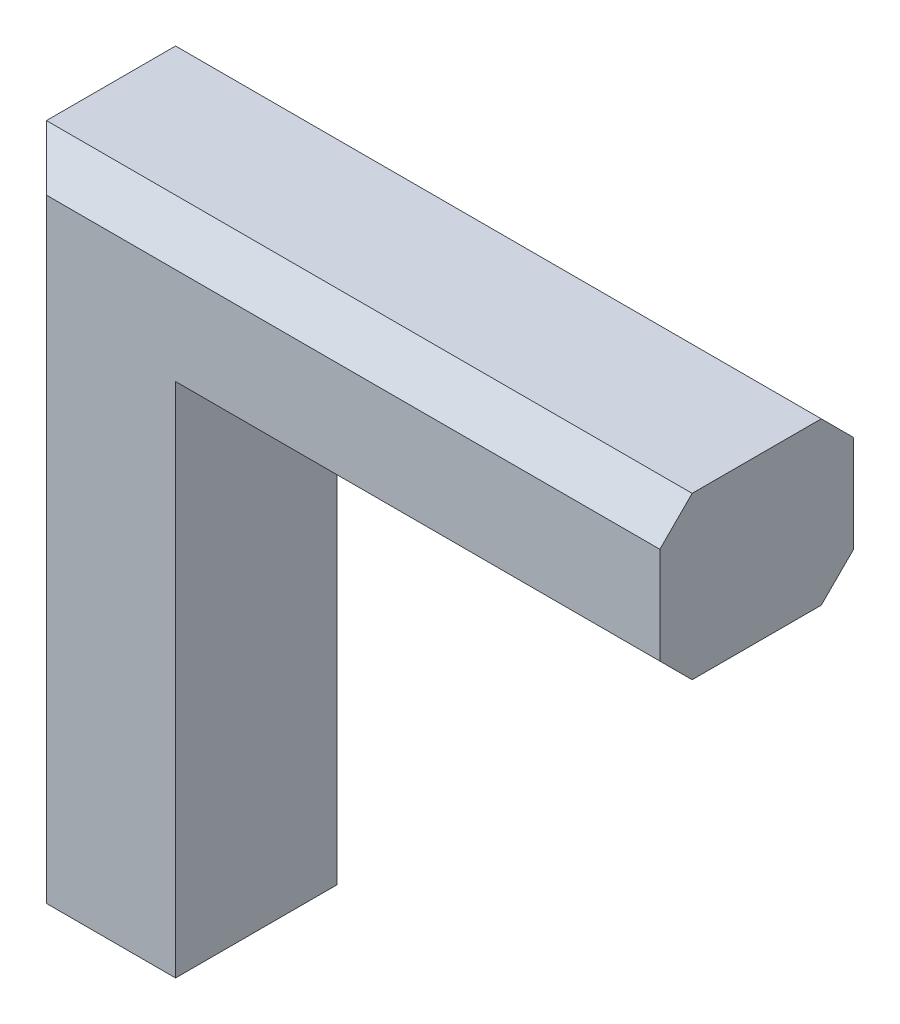
ISO-10303-21;
HEADER;
FILE_DESCRIPTION(('STEP AP214'),'2;1');
FILE_NAME('part.step','',(''),(''),'','','');
FILE_SCHEMA(('AUTOMOTIVE_DESIGN { 1 0 10303 214 1 1 1 1 }'));
ENDSEC;
DATA;
#1=APPLICATION_CONTEXT('core data for automotive mechanical design processes');
#2=APPLICATION_PROTOCOL_DEFINITION('international standard','automotive_design',2000,#1);
#3=PRODUCT_CONTEXT('',#1,'mechanical');
#4=PRODUCT('Part','Part','',(#3));
#5=PRODUCT_RELATED_PRODUCT_CATEGORY('part','',(#4));
#6=PRODUCT_DEFINITION_FORMATION('','',#4);
#7=PRODUCT_DEFINITION_CONTEXT('part definition',#1,'design');
#8=PRODUCT_DEFINITION('design','',#6,#7);
#9=PRODUCT_DEFINITION_SHAPE('','',#8);
#10=(LENGTH_UNIT() NAMED_UNIT(*) SI_UNIT(.MILLI.,.METRE.));
#11=(NAMED_UNIT(*) PLANE_ANGLE_UNIT() SI_UNIT($,.RADIAN.));
#12=(NAMED_UNIT(*) SI_UNIT($,.STERADIAN.) SOLID_ANGLE_UNIT());
#13=UNCERTAINTY_MEASURE_WITH_UNIT(LENGTH_MEASURE(1.E-05),#10,'distance_accuracy_value','');
#14=(GEOMETRIC_REPRESENTATION_CONTEXT(3) GLOBAL_UNCERTAINTY_ASSIGNED_CONTEXT((#13)) GLOBAL_UNIT_ASSIGNED_CONTEXT((#10,
#11,#12)) REPRESENTATION_CONTEXT('',''));
#15=CARTESIAN_POINT('',(0.,0.,0.));
#16=DIRECTION('',(0.,0.,1.));
#17=DIRECTION('',(1.,0.,0.));
#18=AXIS2_PLACEMENT_3D('',#15,#16,#17);
#19=CARTESIAN_POINT('',(0.5,-3.75,0.5));
#20=DIRECTION('',(-0.707106781186547,0.,-0.707106781186548));
#21=DIRECTION('',(-0.707106781186548,0.,0.707106781186547));
#22=AXIS2_PLACEMENT_3D('',#19,#20,#21);
#23=PLANE('',#22);
#24=DIRECTION('',(0.,1.,0.));
#25=VECTOR('',#24,1.);
#26=CARTESIAN_POINT('',(0.,0.,1.));
#27=LINE('',#26,#25);
#28=CARTESIAN_POINT('',(0.,5.,1.));
#29=VERTEX_POINT('',#28);
#30=CARTESIAN_POINT('',(0.,-15.,1.));
#31=VERTEX_POINT('',#30);
#32=EDGE_CURVE('E111',#29,#31,#27,.F.);
#33=ORIENTED_EDGE('',*,*,#32,.F.);
#34=DIRECTION('',(-0.577350269189626,0.577350269189626,0.577350269189625));
#35=VECTOR('',#34,1.);
#36=CARTESIAN_POINT('',(1.,4.,0.));
#37=LINE('',#36,#35);
#38=CARTESIAN_POINT('',(0.999999999999999,4.,0.));
#39=VERTEX_POINT('',#38);
#40=EDGE_CURVE('E105',#39,#29,#37,.T.);
#41=ORIENTED_EDGE('',*,*,#40,.F.);
#42=DIRECTION('',(0.,1.,0.));
#43=VECTOR('',#42,1.);
#44=CARTESIAN_POINT('',(1.,-7.5,0.));
#45=LINE('',#44,#43);
#46=CARTESIAN_POINT('',(1.,-15.,0.));
#47=VERTEX_POINT('',#46);
#48=EDGE_CURVE('E108',#39,#47,#45,.F.);
#49=ORIENTED_EDGE('',*,*,#48,.T.);
#50=DIRECTION('',(-0.707106781186548,0.,0.707106781186547));
#51=VECTOR('',#50,1.);
#52=CARTESIAN_POINT('',(0.5,-15.,0.5));
#53=LINE('',#52,#51);
#54=EDGE_CURVE('E19',#47,#31,#53,.T.);
#55=ORIENTED_EDGE('',*,*,#54,.T.);
#56=EDGE_LOOP('',(#33,#41,#49,#55));
#57=FACE_BOUND('',#56,.T.);
#58=ADVANCED_FACE('F16',(#57),#23,.T.);
#59=CARTESIAN_POINT('',(11.25,4.5,0.5));
#60=DIRECTION('',(0.,0.707106781186547,-0.707106781186548));
#61=DIRECTION('',(0.,0.707106781186548,0.707106781186547));
#62=AXIS2_PLACEMENT_3D('',#59,#60,#61);
#63=PLANE('',#62);
#64=DIRECTION('',(1.,0.,0.));
#65=VECTOR('',#64,1.);
#66=CARTESIAN_POINT('',(2.5,4.,0.));
#67=LINE('',#66,#65);
#68=CARTESIAN_POINT('',(20.,4.,0.));
#69=VERTEX_POINT('',#68);
#70=EDGE_CURVE('E119',#69,#39,#67,.F.);
#71=ORIENTED_EDGE('',*,*,#70,.T.);
#72=ORIENTED_EDGE('',*,*,#40,.T.);
#73=DIRECTION('',(1.,0.,0.));
#74=VECTOR('',#73,1.);
#75=CARTESIAN_POINT('',(20.,5.,1.));
#76=LINE('',#75,#74);
#77=CARTESIAN_POINT('',(20.,5.,1.));
#78=VERTEX_POINT('',#77);
#79=EDGE_CURVE('E171',#78,#29,#76,.F.);
#80=ORIENTED_EDGE('',*,*,#79,.F.);
#81=DIRECTION('',(0.,0.707106781186548,0.707106781186547));
#82=VECTOR('',#81,1.);
#83=CARTESIAN_POINT('',(20.,4.5,0.5));
#84=LINE('',#83,#82);
#85=EDGE_CURVE('E116',#78,#69,#84,.F.);
#86=ORIENTED_EDGE('',*,*,#85,.T.);
#87=EDGE_LOOP('',(#71,#72,#80,#86));
#88=FACE_BOUND('',#87,.T.);
#89=ADVANCED_FACE('F120',(#88),#63,.T.);
#90=CARTESIAN_POINT('',(1.25,0.5,0.5));
#91=DIRECTION('',(0.,-0.707106781186548,-0.707106781186547));
#92=DIRECTION('',(0.,0.707106781186547,-0.707106781186548));
#93=AXIS2_PLACEMENT_3D('',#90,#91,#92);
#94=PLANE('',#93);
#95=DIRECTION('',(1.,0.,0.));
#96=VECTOR('',#95,1.);
#97=CARTESIAN_POINT('',(0.,0.,1.));
#98=LINE('',#97,#96);
#99=CARTESIAN_POINT('',(5.,0.,1.));
#100=VERTEX_POINT('',#99);
#101=CARTESIAN_POINT('',(20.,0.,1.));
#102=VERTEX_POINT('',#101);
#103=EDGE_CURVE('E167',#100,#102,#98,.T.);
#104=ORIENTED_EDGE('',*,*,#103,.F.);
#105=DIRECTION('',(0.577350269189625,-0.577350269189626,0.577350269189626));
#106=VECTOR('',#105,1.);
#107=CARTESIAN_POINT('',(4.,1.,0.));
#108=LINE('',#107,#106);
#109=CARTESIAN_POINT('',(4.,1.,0.));
#110=VERTEX_POINT('',#109);
#111=EDGE_CURVE('E99',#110,#100,#108,.T.);
#112=ORIENTED_EDGE('',*,*,#111,.F.);
#113=DIRECTION('',(1.,0.,0.));
#114=VECTOR('',#113,1.);
#115=CARTESIAN_POINT('',(2.5,1.,0.));
#116=LINE('',#115,#114);
#117=CARTESIAN_POINT('',(20.,1.,0.));
#118=VERTEX_POINT('',#117);
#119=EDGE_CURVE('E131',#110,#118,#116,.T.);
#120=ORIENTED_EDGE('',*,*,#119,.T.);
#121=DIRECTION('',(0.,0.707106781186547,-0.707106781186548));
#122=VECTOR('',#121,1.);
#123=CARTESIAN_POINT('',(20.,0.5,0.5));
#124=LINE('',#123,#122);
#125=EDGE_CURVE('E115',#118,#102,#124,.F.);
#126=ORIENTED_EDGE('',*,*,#125,.T.);
#127=EDGE_LOOP('',(#104,#112,#120,#126));
#128=FACE_BOUND('',#127,.T.);
#129=ADVANCED_FACE('F173',(#128),#94,.T.);
#130=CARTESIAN_POINT('',(0.,0.,0.));
#131=DIRECTION('',(-1.,0.,0.));
#132=DIRECTION('',(0.,0.,1.));
#133=AXIS2_PLACEMENT_3D('',#130,#131,#132);
#134=PLANE('',#133);
#135=DIRECTION('',(0.,1.,0.));
#136=VECTOR('',#135,1.);
#137=CARTESIAN_POINT('',(0.,-3.75,5.));
#138=LINE('',#137,#136);
#139=CARTESIAN_POINT('',(0.,5.,5.));
#140=VERTEX_POINT('',#139);
#141=CARTESIAN_POINT('',(0.,-15.,5.));
#142=VERTEX_POINT('',#141);
#143=EDGE_CURVE('E159',#140,#142,#138,.F.);
#144=ORIENTED_EDGE('',*,*,#143,.F.);
#145=DIRECTION('',(0.,0.,1.));
#146=VECTOR('',#145,1.);
#147=CARTESIAN_POINT('',(0.,5.,0.));
#148=LINE('',#147,#146);
#149=EDGE_CURVE('E145',#29,#140,#148,.T.);
#150=ORIENTED_EDGE('',*,*,#149,.F.);
#151=ORIENTED_EDGE('',*,*,#32,.T.);
#152=DIRECTION('',(0.,0.,-1.));
#153=VECTOR('',#152,1.);
#154=CARTESIAN_POINT('',(0.,-15.,0.));
#155=LINE('',#154,#153);
#156=EDGE_CURVE('E143',#142,#31,#155,.T.);
#157=ORIENTED_EDGE('',*,*,#156,.F.);
#158=EDGE_LOOP('',(#144,#150,#151,#157));
#159=FACE_BOUND('',#158,.T.);
#160=ADVANCED_FACE('F142',(#159),#134,.T.);
#161=CARTESIAN_POINT('',(4.5,-11.25,0.5));
#162=DIRECTION('',(0.707106781186548,0.,-0.707106781186547));
#163=DIRECTION('',(-0.707106781186547,0.,-0.707106781186548));
#164=AXIS2_PLACEMENT_3D('',#161,#162,#163);
#165=PLANE('',#164);
#166=DIRECTION('',(0.,1.,0.));
#167=VECTOR('',#166,1.);
#168=CARTESIAN_POINT('',(4.,-7.5,0.));
#169=LINE('',#168,#167);
#170=CARTESIAN_POINT('',(4.,-15.,0.));
#171=VERTEX_POINT('',#170);
#172=EDGE_CURVE('E129',#171,#110,#169,.T.);
#173=ORIENTED_EDGE('',*,*,#172,.T.);
#174=ORIENTED_EDGE('',*,*,#111,.T.);
#175=DIRECTION('',(0.,1.,0.));
#176=VECTOR('',#175,1.);
#177=CARTESIAN_POINT('',(5.,-15.,1.));
#178=LINE('',#177,#176);
#179=CARTESIAN_POINT('',(5.,-15.,1.));
#180=VERTEX_POINT('',#179);
#181=EDGE_CURVE('E151',#180,#100,#178,.T.);
#182=ORIENTED_EDGE('',*,*,#181,.F.);
#183=DIRECTION('',(0.707106781186548,0.,0.707106781186548));
#184=VECTOR('',#183,1.);
#185=CARTESIAN_POINT('',(4.,-15.,0.));
#186=LINE('',#185,#184);
#187=EDGE_CURVE('E153',#171,#180,#186,.T.);
#188=ORIENTED_EDGE('',*,*,#187,.F.);
#189=EDGE_LOOP('',(#173,#174,#182,#188));
#190=FACE_BOUND('',#189,.T.);
#191=ADVANCED_FACE('F199',(#190),#165,.T.);
#192=CARTESIAN_POINT('',(2.5,-7.5,0.));
#193=DIRECTION('',(0.,0.,1.));
#194=DIRECTION('',(1.,0.,0.));
#195=AXIS2_PLACEMENT_3D('',#192,#193,#194);
#196=PLANE('',#195);
#197=ORIENTED_EDGE('',*,*,#172,.F.);
#198=DIRECTION('',(1.,0.,0.));
#199=VECTOR('',#198,1.);
#200=CARTESIAN_POINT('',(0.,-15.,0.));
#201=LINE('',#200,#199);
#202=EDGE_CURVE('E128',#47,#171,#201,.T.);
#203=ORIENTED_EDGE('',*,*,#202,.F.);
#204=ORIENTED_EDGE('',*,*,#48,.F.);
#205=ORIENTED_EDGE('',*,*,#70,.F.);
#206=DIRECTION('',(0.,1.,0.));
#207=VECTOR('',#206,1.);
#208=CARTESIAN_POINT('',(20.,0.,0.));
#209=LINE('',#208,#207);
#210=EDGE_CURVE('E174',#118,#69,#209,.T.);
#211=ORIENTED_EDGE('',*,*,#210,.F.);
#212=ORIENTED_EDGE('',*,*,#119,.F.);
#213=EDGE_LOOP('',(#197,#203,#204,#205,#211,#212));
#214=FACE_BOUND('',#213,.T.);
#215=ADVANCED_FACE('F126',(#214),#196,.F.);
#216=CARTESIAN_POINT('',(20.,5.,0.));
#217=DIRECTION('',(0.,1.,0.));
#218=DIRECTION('',(0.,0.,1.));
#219=AXIS2_PLACEMENT_3D('',#216,#217,#218);
#220=PLANE('',#219);
#221=ORIENTED_EDGE('',*,*,#79,.T.);
#222=ORIENTED_EDGE('',*,*,#149,.T.);
#223=DIRECTION('',(1.,0.,0.));
#224=VECTOR('',#223,1.);
#225=CARTESIAN_POINT('',(11.25,5.,5.));
#226=LINE('',#225,#224);
#227=CARTESIAN_POINT('',(20.,5.,5.));
#228=VERTEX_POINT('',#227);
#229=EDGE_CURVE('E164',#228,#140,#226,.F.);
#230=ORIENTED_EDGE('',*,*,#229,.F.);
#231=DIRECTION('',(0.,0.,-1.));
#232=VECTOR('',#231,1.);
#233=CARTESIAN_POINT('',(20.,5.,0.));
#234=LINE('',#233,#232);
#235=EDGE_CURVE('E176',#78,#228,#234,.F.);
#236=ORIENTED_EDGE('',*,*,#235,.F.);
#237=EDGE_LOOP('',(#221,#222,#230,#236));
#238=FACE_BOUND('',#237,.T.);
#239=ADVANCED_FACE('F232',(#238),#220,.T.);
#240=CARTESIAN_POINT('',(0.,0.,0.));
#241=DIRECTION('',(0.,-1.,0.));
#242=DIRECTION('',(0.,0.,-1.));
#243=AXIS2_PLACEMENT_3D('',#240,#241,#242);
#244=PLANE('',#243);
#245=DIRECTION('',(1.,0.,0.));
#246=VECTOR('',#245,1.);
#247=CARTESIAN_POINT('',(1.25,0.,5.));
#248=LINE('',#247,#246);
#249=CARTESIAN_POINT('',(5.,0.,5.));
#250=VERTEX_POINT('',#249);
#251=CARTESIAN_POINT('',(20.,0.,5.));
#252=VERTEX_POINT('',#251);
#253=EDGE_CURVE('E177',#250,#252,#248,.T.);
#254=ORIENTED_EDGE('',*,*,#253,.F.);
#255=DIRECTION('',(0.,0.,-1.));
#256=VECTOR('',#255,1.);
#257=CARTESIAN_POINT('',(5.,0.,0.));
#258=LINE('',#257,#256);
#259=EDGE_CURVE('E191',#100,#250,#258,.F.);
#260=ORIENTED_EDGE('',*,*,#259,.F.);
#261=ORIENTED_EDGE('',*,*,#103,.T.);
#262=DIRECTION('',(0.,0.,-1.));
#263=VECTOR('',#262,1.);
#264=CARTESIAN_POINT('',(20.,0.,0.));
#265=LINE('',#264,#263);
#266=EDGE_CURVE('E218',#252,#102,#265,.T.);
#267=ORIENTED_EDGE('',*,*,#266,.F.);
#268=EDGE_LOOP('',(#254,#260,#261,#267));
#269=FACE_BOUND('',#268,.T.);
#270=ADVANCED_FACE('F229',(#269),#244,.T.);
#271=CARTESIAN_POINT('',(11.25,4.5,5.5));
#272=DIRECTION('',(0.,0.707106781186547,0.707106781186548));
#273=DIRECTION('',(0.,-0.707106781186548,0.707106781186547));
#274=AXIS2_PLACEMENT_3D('',#271,#272,#273);
#275=PLANE('',#274);
#276=DIRECTION('',(0.,-0.707106781186548,0.707106781186548));
#277=VECTOR('',#276,1.);
#278=CARTESIAN_POINT('',(20.,5.,5.));
#279=LINE('',#278,#277);
#280=CARTESIAN_POINT('',(20.,4.,6.));
#281=VERTEX_POINT('',#280);
#282=EDGE_CURVE('E180',#228,#281,#279,.T.);
#283=ORIENTED_EDGE('',*,*,#282,.F.);
#284=ORIENTED_EDGE('',*,*,#229,.T.);
#285=DIRECTION('',(-0.577350269189626,0.577350269189626,-0.577350269189625));
#286=VECTOR('',#285,1.);
#287=CARTESIAN_POINT('',(1.,4.,6.));
#288=LINE('',#287,#286);
#289=CARTESIAN_POINT('',(1.,4.,6.));
#290=VERTEX_POINT('',#289);
#291=EDGE_CURVE('E161',#290,#140,#288,.T.);
#292=ORIENTED_EDGE('',*,*,#291,.F.);
#293=DIRECTION('',(1.,0.,0.));
#294=VECTOR('',#293,1.);
#295=CARTESIAN_POINT('',(2.5,4.,6.));
#296=LINE('',#295,#294);
#297=EDGE_CURVE('E213',#281,#290,#296,.F.);
#298=ORIENTED_EDGE('',*,*,#297,.F.);
#299=EDGE_LOOP('',(#283,#284,#292,#298));
#300=FACE_BOUND('',#299,.T.);
#301=ADVANCED_FACE('F231',(#300),#275,.T.);
#302=CARTESIAN_POINT('',(0.5,-3.75,5.5));
#303=DIRECTION('',(-0.707106781186547,0.,0.707106781186548));
#304=DIRECTION('',(0.707106781186548,0.,0.707106781186547));
#305=AXIS2_PLACEMENT_3D('',#302,#303,#304);
#306=PLANE('',#305);
#307=DIRECTION('',(-0.707106781186548,0.,-0.707106781186548));
#308=VECTOR('',#307,1.);
#309=CARTESIAN_POINT('',(1.,-15.,6.));
#310=LINE('',#309,#308);
#311=CARTESIAN_POINT('',(1.,-15.,6.));
#312=VERTEX_POINT('',#311);
#313=EDGE_CURVE('E149',#312,#142,#310,.T.);
#314=ORIENTED_EDGE('',*,*,#313,.F.);
#315=DIRECTION('',(0.,1.,0.));
#316=VECTOR('',#315,1.);
#317=CARTESIAN_POINT('',(1.,-7.5,6.));
#318=LINE('',#317,#316);
#319=EDGE_CURVE('E211',#290,#312,#318,.F.);
#320=ORIENTED_EDGE('',*,*,#319,.F.);
#321=ORIENTED_EDGE('',*,*,#291,.T.);
#322=ORIENTED_EDGE('',*,*,#143,.T.);
#323=EDGE_LOOP('',(#314,#320,#321,#322));
#324=FACE_BOUND('',#323,.T.);
#325=ADVANCED_FACE('F239',(#324),#306,.T.);
#326=CARTESIAN_POINT('',(0.,-15.,0.));
#327=DIRECTION('',(0.,-1.,0.));
#328=DIRECTION('',(0.,0.,-1.));
#329=AXIS2_PLACEMENT_3D('',#326,#327,#328);
#330=PLANE('',#329);
#331=ORIENTED_EDGE('',*,*,#54,.F.);
#332=ORIENTED_EDGE('',*,*,#202,.T.);
#333=ORIENTED_EDGE('',*,*,#187,.T.);
#334=DIRECTION('',(0.,0.,-1.));
#335=VECTOR('',#334,1.);
#336=CARTESIAN_POINT('',(5.,-15.,0.));
#337=LINE('',#336,#335);
#338=CARTESIAN_POINT('',(5.,-15.,6.));
#339=VERTEX_POINT('',#338);
#340=EDGE_CURVE('E188',#339,#180,#337,.T.);
#341=ORIENTED_EDGE('',*,*,#340,.F.);
#342=DIRECTION('',(1.,0.,0.));
#343=VECTOR('',#342,1.);
#344=CARTESIAN_POINT('',(2.5,-15.,6.));
#345=LINE('',#344,#343);
#346=EDGE_CURVE('E201',#312,#339,#345,.T.);
#347=ORIENTED_EDGE('',*,*,#346,.F.);
#348=ORIENTED_EDGE('',*,*,#313,.T.);
#349=ORIENTED_EDGE('',*,*,#156,.T.);
#350=EDGE_LOOP('',(#331,#332,#333,#341,#347,#348,#349));
#351=FACE_BOUND('',#350,.T.);
#352=ADVANCED_FACE('F147',(#351),#330,.T.);
#353=CARTESIAN_POINT('',(5.,-15.,0.));
#354=DIRECTION('',(1.,0.,0.));
#355=DIRECTION('',(0.,0.,-1.));
#356=AXIS2_PLACEMENT_3D('',#353,#354,#355);
#357=PLANE('',#356);
#358=DIRECTION('',(0.,1.,0.));
#359=VECTOR('',#358,1.);
#360=CARTESIAN_POINT('',(5.,-7.5,6.));
#361=LINE('',#360,#359);
#362=CARTESIAN_POINT('',(5.,1.,6.));
#363=VERTEX_POINT('',#362);
#364=EDGE_CURVE('E204',#339,#363,#361,.T.);
#365=ORIENTED_EDGE('',*,*,#364,.F.);
#366=ORIENTED_EDGE('',*,*,#340,.T.);
#367=ORIENTED_EDGE('',*,*,#181,.T.);
#368=ORIENTED_EDGE('',*,*,#259,.T.);
#369=DIRECTION('',(0.,-0.707106781186548,-0.707106781186547));
#370=VECTOR('',#369,1.);
#371=CARTESIAN_POINT('',(5.,0.5,5.5));
#372=LINE('',#371,#370);
#373=EDGE_CURVE('E182',#363,#250,#372,.T.);
#374=ORIENTED_EDGE('',*,*,#373,.F.);
#375=EDGE_LOOP('',(#365,#366,#367,#368,#374));
#376=FACE_BOUND('',#375,.T.);
#377=ADVANCED_FACE('F195',(#376),#357,.T.);
#378=CARTESIAN_POINT('',(1.25,0.5,5.5));
#379=DIRECTION('',(0.,-0.707106781186547,0.707106781186548));
#380=DIRECTION('',(0.,-0.707106781186548,-0.707106781186547));
#381=AXIS2_PLACEMENT_3D('',#378,#379,#380);
#382=PLANE('',#381);
#383=ORIENTED_EDGE('',*,*,#373,.T.);
#384=ORIENTED_EDGE('',*,*,#253,.T.);
#385=DIRECTION('',(0.,-0.707106781186548,-0.707106781186548));
#386=VECTOR('',#385,1.);
#387=CARTESIAN_POINT('',(20.,1.,6.));
#388=LINE('',#387,#386);
#389=CARTESIAN_POINT('',(20.,1.,6.));
#390=VERTEX_POINT('',#389);
#391=EDGE_CURVE('E34',#390,#252,#388,.T.);
#392=ORIENTED_EDGE('',*,*,#391,.F.);
#393=DIRECTION('',(1.,0.,0.));
#394=VECTOR('',#393,1.);
#395=CARTESIAN_POINT('',(2.5,1.,6.));
#396=LINE('',#395,#394);
#397=EDGE_CURVE('E25',#363,#390,#396,.T.);
#398=ORIENTED_EDGE('',*,*,#397,.F.);
#399=EDGE_LOOP('',(#383,#384,#392,#398));
#400=FACE_BOUND('',#399,.T.);
#401=ADVANCED_FACE('F226',(#400),#382,.T.);
#402=CARTESIAN_POINT('',(20.,0.,0.));
#403=DIRECTION('',(1.,0.,0.));
#404=DIRECTION('',(0.,0.,-1.));
#405=AXIS2_PLACEMENT_3D('',#402,#403,#404);
#406=PLANE('',#405);
#407=ORIENTED_EDGE('',*,*,#391,.T.);
#408=ORIENTED_EDGE('',*,*,#266,.T.);
#409=ORIENTED_EDGE('',*,*,#125,.F.);
#410=ORIENTED_EDGE('',*,*,#210,.T.);
#411=ORIENTED_EDGE('',*,*,#85,.F.);
#412=ORIENTED_EDGE('',*,*,#235,.T.);
#413=ORIENTED_EDGE('',*,*,#282,.T.);
#414=DIRECTION('',(0.,1.,0.));
#415=VECTOR('',#414,1.);
#416=CARTESIAN_POINT('',(20.,-7.5,6.));
#417=LINE('',#416,#415);
#418=EDGE_CURVE('E10',#390,#281,#417,.T.);
#419=ORIENTED_EDGE('',*,*,#418,.F.);
#420=EDGE_LOOP('',(#407,#408,#409,#410,#411,#412,#413,#419));
#421=FACE_BOUND('',#420,.T.);
#422=ADVANCED_FACE('F223',(#421),#406,.T.);
#423=CARTESIAN_POINT('',(2.5,-7.5,6.));
#424=DIRECTION('',(0.,0.,1.));
#425=DIRECTION('',(1.,0.,0.));
#426=AXIS2_PLACEMENT_3D('',#423,#424,#425);
#427=PLANE('',#426);
#428=ORIENTED_EDGE('',*,*,#397,.T.);
#429=ORIENTED_EDGE('',*,*,#418,.T.);
#430=ORIENTED_EDGE('',*,*,#297,.T.);
#431=ORIENTED_EDGE('',*,*,#319,.T.);
#432=ORIENTED_EDGE('',*,*,#346,.T.);
#433=ORIENTED_EDGE('',*,*,#364,.T.);
#434=EDGE_LOOP('',(#428,#429,#430,#431,#432,#433));
#435=FACE_BOUND('',#434,.T.);
#436=ADVANCED_FACE('F208',(#435),#427,.T.);
#437=CLOSED_SHELL('',(#58,#89,#129,#160,#191,#215,#239,#270,#301,#325,#352,#377,#401,#422,#436));
#438=MANIFOLD_SOLID_BREP('B1',#437);
#439=ADVANCED_BREP_SHAPE_REPRESENTATION('',(#18,#438),#14);
#440=SHAPE_DEFINITION_REPRESENTATION(#9,#439);
ENDSEC;
END-ISO-10303-21;
